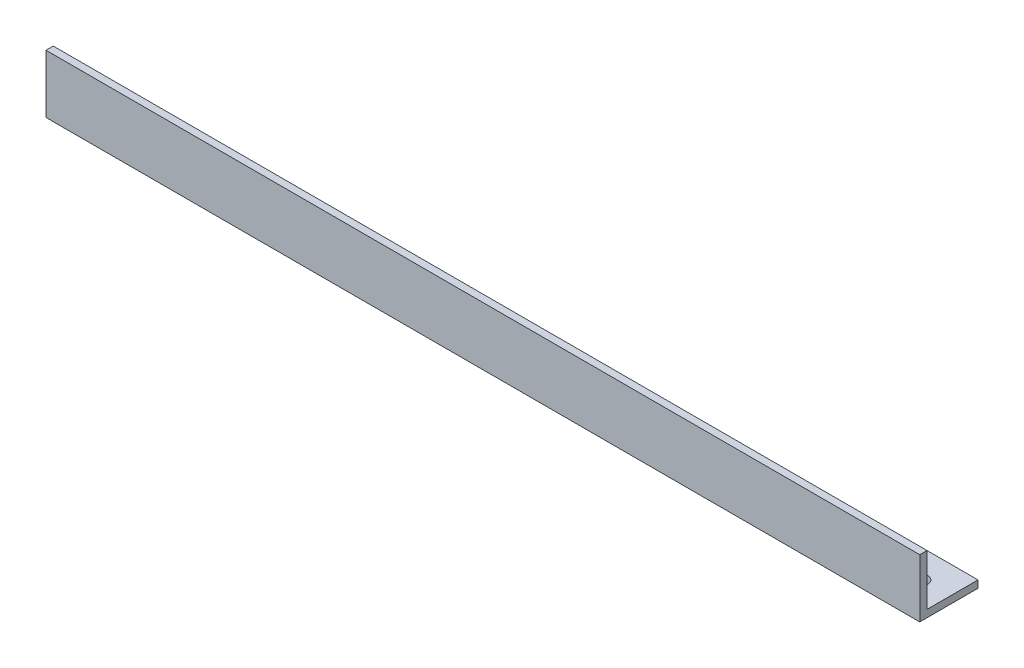
ISO-10303-21;
HEADER;
FILE_DESCRIPTION(('STEP AP214'),'2;1');
FILE_NAME('part.step','',(''),(''),'','','');
FILE_SCHEMA(('AUTOMOTIVE_DESIGN { 1 0 10303 214 1 1 1 1 }'));
ENDSEC;
DATA;
#1=APPLICATION_CONTEXT('core data for automotive mechanical design processes');
#2=APPLICATION_PROTOCOL_DEFINITION('international standard','automotive_design',2000,#1);
#3=PRODUCT_CONTEXT('',#1,'mechanical');
#4=PRODUCT('Part','Part','',(#3));
#5=PRODUCT_RELATED_PRODUCT_CATEGORY('part','',(#4));
#6=PRODUCT_DEFINITION_FORMATION('','',#4);
#7=PRODUCT_DEFINITION_CONTEXT('part definition',#1,'design');
#8=PRODUCT_DEFINITION('design','',#6,#7);
#9=PRODUCT_DEFINITION_SHAPE('','',#8);
#10=(LENGTH_UNIT() NAMED_UNIT(*) SI_UNIT(.MILLI.,.METRE.));
#11=(NAMED_UNIT(*) PLANE_ANGLE_UNIT() SI_UNIT($,.RADIAN.));
#12=(NAMED_UNIT(*) SI_UNIT($,.STERADIAN.) SOLID_ANGLE_UNIT());
#13=UNCERTAINTY_MEASURE_WITH_UNIT(LENGTH_MEASURE(1.E-05),#10,'distance_accuracy_value','');
#14=(GEOMETRIC_REPRESENTATION_CONTEXT(3) GLOBAL_UNCERTAINTY_ASSIGNED_CONTEXT((#13)) GLOBAL_UNIT_ASSIGNED_CONTEXT((#10,
#11,#12)) REPRESENTATION_CONTEXT('',''));
#15=CARTESIAN_POINT('',(0.,0.,0.));
#16=DIRECTION('',(0.,0.,1.));
#17=DIRECTION('',(1.,0.,0.));
#18=AXIS2_PLACEMENT_3D('',#15,#16,#17);
#19=CARTESIAN_POINT('',(381.,0.,0.));
#20=DIRECTION('',(0.,0.,-1.));
#21=DIRECTION('',(-1.,0.,0.));
#22=AXIS2_PLACEMENT_3D('',#19,#20,#21);
#23=PLANE('',#22);
#24=DIRECTION('',(0.,-1.,0.));
#25=VECTOR('',#24,1.);
#26=CARTESIAN_POINT('',(0.,0.,0.));
#27=LINE('',#26,#25);
#28=CARTESIAN_POINT('',(0.,25.4,0.));
#29=VERTEX_POINT('',#28);
#30=CARTESIAN_POINT('',(0.,0.,0.));
#31=VERTEX_POINT('',#30);
#32=EDGE_CURVE('E117',#29,#31,#27,.T.);
#33=ORIENTED_EDGE('',*,*,#32,.T.);
#34=DIRECTION('',(-1.,0.,0.));
#35=VECTOR('',#34,1.);
#36=CARTESIAN_POINT('',(381.,0.,0.));
#37=LINE('',#36,#35);
#38=CARTESIAN_POINT('',(381.,0.,0.));
#39=VERTEX_POINT('',#38);
#40=EDGE_CURVE('E11',#39,#31,#37,.T.);
#41=ORIENTED_EDGE('',*,*,#40,.F.);
#42=DIRECTION('',(0.,-1.,0.));
#43=VECTOR('',#42,1.);
#44=CARTESIAN_POINT('',(381.,0.,0.));
#45=LINE('',#44,#43);
#46=CARTESIAN_POINT('',(381.,25.4,0.));
#47=VERTEX_POINT('',#46);
#48=EDGE_CURVE('E128',#47,#39,#45,.T.);
#49=ORIENTED_EDGE('',*,*,#48,.F.);
#50=DIRECTION('',(-1.,0.,0.));
#51=VECTOR('',#50,1.);
#52=CARTESIAN_POINT('',(381.,25.4,0.));
#53=LINE('',#52,#51);
#54=EDGE_CURVE('E113',#47,#29,#53,.T.);
#55=ORIENTED_EDGE('',*,*,#54,.T.);
#56=EDGE_LOOP('',(#33,#41,#49,#55));
#57=FACE_BOUND('',#56,.T.);
#58=ADVANCED_FACE('F33',(#57),#23,.F.);
#59=CARTESIAN_POINT('',(381.,0.,0.));
#60=DIRECTION('',(0.,1.,0.));
#61=DIRECTION('',(0.,0.,1.));
#62=AXIS2_PLACEMENT_3D('',#59,#60,#61);
#63=PLANE('',#62);
#64=CARTESIAN_POINT('',(19.05,0.,-12.7));
#65=DIRECTION('',(0.,-1.,0.));
#66=DIRECTION('',(0.,0.,-1.));
#67=AXIS2_PLACEMENT_3D('',#64,#65,#66);
#68=CIRCLE('',#67,3.429);
#69=CARTESIAN_POINT('',(19.05,0.,-16.129));
#70=VERTEX_POINT('',#69);
#71=EDGE_CURVE('E188',#70,#70,#68,.T.);
#72=ORIENTED_EDGE('',*,*,#71,.F.);
#73=EDGE_LOOP('',(#72));
#74=FACE_BOUND('',#73,.T.);
#75=CARTESIAN_POINT('',(368.3,0.,-12.7));
#76=DIRECTION('',(0.,-1.,0.));
#77=DIRECTION('',(0.,0.,-1.));
#78=AXIS2_PLACEMENT_3D('',#75,#76,#77);
#79=CIRCLE('',#78,3.429);
#80=CARTESIAN_POINT('',(368.3,0.,-16.129));
#81=VERTEX_POINT('',#80);
#82=EDGE_CURVE('E187',#81,#81,#79,.T.);
#83=ORIENTED_EDGE('',*,*,#82,.F.);
#84=EDGE_LOOP('',(#83));
#85=FACE_BOUND('',#84,.T.);
#86=CARTESIAN_POINT('',(73.66,0.,-12.7));
#87=DIRECTION('',(0.,-1.,0.));
#88=DIRECTION('',(0.,0.,-1.));
#89=AXIS2_PLACEMENT_3D('',#86,#87,#88);
#90=CIRCLE('',#89,3.429);
#91=CARTESIAN_POINT('',(73.66,0.,-16.129));
#92=VERTEX_POINT('',#91);
#93=EDGE_CURVE('E179',#92,#92,#90,.T.);
#94=ORIENTED_EDGE('',*,*,#93,.F.);
#95=EDGE_LOOP('',(#94));
#96=FACE_BOUND('',#95,.T.);
#97=DIRECTION('',(0.,0.,-1.));
#98=VECTOR('',#97,1.);
#99=CARTESIAN_POINT('',(0.,0.,0.));
#100=LINE('',#99,#98);
#101=CARTESIAN_POINT('',(0.,0.,-25.4));
#102=VERTEX_POINT('',#101);
#103=EDGE_CURVE('E120',#31,#102,#100,.T.);
#104=ORIENTED_EDGE('',*,*,#103,.T.);
#105=DIRECTION('',(-1.,0.,0.));
#106=VECTOR('',#105,1.);
#107=CARTESIAN_POINT('',(381.,0.,-25.4));
#108=LINE('',#107,#106);
#109=CARTESIAN_POINT('',(381.,0.,-25.4));
#110=VERTEX_POINT('',#109);
#111=EDGE_CURVE('E41',#110,#102,#108,.T.);
#112=ORIENTED_EDGE('',*,*,#111,.F.);
#113=DIRECTION('',(0.,0.,-1.));
#114=VECTOR('',#113,1.);
#115=CARTESIAN_POINT('',(381.,0.,0.));
#116=LINE('',#115,#114);
#117=EDGE_CURVE('E86',#39,#110,#116,.T.);
#118=ORIENTED_EDGE('',*,*,#117,.F.);
#119=ORIENTED_EDGE('',*,*,#40,.T.);
#120=EDGE_LOOP('',(#104,#112,#118,#119));
#121=FACE_BOUND('',#120,.T.);
#122=ADVANCED_FACE('F152',(#74,#85,#96,#121),#63,.F.);
#123=CARTESIAN_POINT('',(381.,3.175,-25.4));
#124=DIRECTION('',(0.,0.,1.));
#125=DIRECTION('',(1.,0.,0.));
#126=AXIS2_PLACEMENT_3D('',#123,#124,#125);
#127=PLANE('',#126);
#128=DIRECTION('',(0.,1.,0.));
#129=VECTOR('',#128,1.);
#130=CARTESIAN_POINT('',(0.,3.175,-25.4));
#131=LINE('',#130,#129);
#132=CARTESIAN_POINT('',(0.,3.175,-25.4));
#133=VERTEX_POINT('',#132);
#134=EDGE_CURVE('E123',#102,#133,#131,.T.);
#135=ORIENTED_EDGE('',*,*,#134,.T.);
#136=DIRECTION('',(-1.,0.,0.));
#137=VECTOR('',#136,1.);
#138=CARTESIAN_POINT('',(381.,3.175,-25.4));
#139=LINE('',#138,#137);
#140=CARTESIAN_POINT('',(381.,3.175,-25.4));
#141=VERTEX_POINT('',#140);
#142=EDGE_CURVE('E108',#141,#133,#139,.T.);
#143=ORIENTED_EDGE('',*,*,#142,.F.);
#144=DIRECTION('',(0.,1.,0.));
#145=VECTOR('',#144,1.);
#146=CARTESIAN_POINT('',(381.,3.175,-25.4));
#147=LINE('',#146,#145);
#148=EDGE_CURVE('E99',#110,#141,#147,.T.);
#149=ORIENTED_EDGE('',*,*,#148,.F.);
#150=ORIENTED_EDGE('',*,*,#111,.T.);
#151=EDGE_LOOP('',(#135,#143,#149,#150));
#152=FACE_BOUND('',#151,.T.);
#153=ADVANCED_FACE('F134',(#152),#127,.F.);
#154=CARTESIAN_POINT('',(381.,3.175,-3.175));
#155=DIRECTION('',(0.,-1.,0.));
#156=DIRECTION('',(0.,0.,-1.));
#157=AXIS2_PLACEMENT_3D('',#154,#155,#156);
#158=PLANE('',#157);
#159=CARTESIAN_POINT('',(19.05,3.175,-12.7));
#160=DIRECTION('',(0.,-1.,0.));
#161=DIRECTION('',(0.,0.,-1.));
#162=AXIS2_PLACEMENT_3D('',#159,#160,#161);
#163=CIRCLE('',#162,3.429);
#164=CARTESIAN_POINT('',(19.05,3.175,-16.129));
#165=VERTEX_POINT('',#164);
#166=EDGE_CURVE('E171',#165,#165,#163,.F.);
#167=ORIENTED_EDGE('',*,*,#166,.F.);
#168=EDGE_LOOP('',(#167));
#169=FACE_BOUND('',#168,.T.);
#170=CARTESIAN_POINT('',(368.3,3.175,-12.7));
#171=DIRECTION('',(0.,-1.,0.));
#172=DIRECTION('',(0.,0.,-1.));
#173=AXIS2_PLACEMENT_3D('',#170,#171,#172);
#174=CIRCLE('',#173,3.429);
#175=CARTESIAN_POINT('',(368.3,3.175,-16.129));
#176=VERTEX_POINT('',#175);
#177=EDGE_CURVE('E175',#176,#176,#174,.F.);
#178=ORIENTED_EDGE('',*,*,#177,.F.);
#179=EDGE_LOOP('',(#178));
#180=FACE_BOUND('',#179,.T.);
#181=CARTESIAN_POINT('',(73.66,3.175,-12.7));
#182=DIRECTION('',(0.,-1.,0.));
#183=DIRECTION('',(0.,0.,-1.));
#184=AXIS2_PLACEMENT_3D('',#181,#182,#183);
#185=CIRCLE('',#184,3.429);
#186=CARTESIAN_POINT('',(73.66,3.175,-16.129));
#187=VERTEX_POINT('',#186);
#188=EDGE_CURVE('E121',#187,#187,#185,.F.);
#189=ORIENTED_EDGE('',*,*,#188,.F.);
#190=EDGE_LOOP('',(#189));
#191=FACE_BOUND('',#190,.T.);
#192=DIRECTION('',(0.,0.,1.));
#193=VECTOR('',#192,1.);
#194=CARTESIAN_POINT('',(0.,3.175,-3.175));
#195=LINE('',#194,#193);
#196=CARTESIAN_POINT('',(0.,3.175,-3.175));
#197=VERTEX_POINT('',#196);
#198=EDGE_CURVE('E107',#133,#197,#195,.T.);
#199=ORIENTED_EDGE('',*,*,#198,.T.);
#200=DIRECTION('',(-1.,0.,0.));
#201=VECTOR('',#200,1.);
#202=CARTESIAN_POINT('',(381.,3.175,-3.175));
#203=LINE('',#202,#201);
#204=CARTESIAN_POINT('',(381.,3.175,-3.175));
#205=VERTEX_POINT('',#204);
#206=EDGE_CURVE('E104',#205,#197,#203,.T.);
#207=ORIENTED_EDGE('',*,*,#206,.F.);
#208=DIRECTION('',(0.,0.,1.));
#209=VECTOR('',#208,1.);
#210=CARTESIAN_POINT('',(381.,3.175,-3.175));
#211=LINE('',#210,#209);
#212=EDGE_CURVE('E93',#141,#205,#211,.T.);
#213=ORIENTED_EDGE('',*,*,#212,.F.);
#214=ORIENTED_EDGE('',*,*,#142,.T.);
#215=EDGE_LOOP('',(#199,#207,#213,#214));
#216=FACE_BOUND('',#215,.T.);
#217=ADVANCED_FACE('F105',(#169,#180,#191,#216),#158,.F.);
#218=CARTESIAN_POINT('',(381.,25.4,-3.175));
#219=DIRECTION('',(0.,0.,1.));
#220=DIRECTION('',(0.,-1.,0.));
#221=AXIS2_PLACEMENT_3D('',#218,#219,#220);
#222=PLANE('',#221);
#223=DIRECTION('',(0.,1.,0.));
#224=VECTOR('',#223,1.);
#225=CARTESIAN_POINT('',(0.,25.4,-3.175));
#226=LINE('',#225,#224);
#227=CARTESIAN_POINT('',(0.,25.4,-3.175));
#228=VERTEX_POINT('',#227);
#229=EDGE_CURVE('E72',#197,#228,#226,.T.);
#230=ORIENTED_EDGE('',*,*,#229,.T.);
#231=DIRECTION('',(-1.,0.,0.));
#232=VECTOR('',#231,1.);
#233=CARTESIAN_POINT('',(381.,25.4,-3.175));
#234=LINE('',#233,#232);
#235=CARTESIAN_POINT('',(381.,25.4,-3.175));
#236=VERTEX_POINT('',#235);
#237=EDGE_CURVE('E109',#236,#228,#234,.T.);
#238=ORIENTED_EDGE('',*,*,#237,.F.);
#239=DIRECTION('',(0.,1.,0.));
#240=VECTOR('',#239,1.);
#241=CARTESIAN_POINT('',(381.,25.4,-3.175));
#242=LINE('',#241,#240);
#243=EDGE_CURVE('E97',#205,#236,#242,.T.);
#244=ORIENTED_EDGE('',*,*,#243,.F.);
#245=ORIENTED_EDGE('',*,*,#206,.T.);
#246=EDGE_LOOP('',(#230,#238,#244,#245));
#247=FACE_BOUND('',#246,.T.);
#248=ADVANCED_FACE('F111',(#247),#222,.F.);
#249=CARTESIAN_POINT('',(381.,25.4,0.));
#250=DIRECTION('',(0.,-1.,0.));
#251=DIRECTION('',(0.,0.,-1.));
#252=AXIS2_PLACEMENT_3D('',#249,#250,#251);
#253=PLANE('',#252);
#254=DIRECTION('',(0.,0.,1.));
#255=VECTOR('',#254,1.);
#256=CARTESIAN_POINT('',(0.,25.4,0.));
#257=LINE('',#256,#255);
#258=EDGE_CURVE('E78',#228,#29,#257,.T.);
#259=ORIENTED_EDGE('',*,*,#258,.T.);
#260=ORIENTED_EDGE('',*,*,#54,.F.);
#261=DIRECTION('',(0.,0.,1.));
#262=VECTOR('',#261,1.);
#263=CARTESIAN_POINT('',(381.,25.4,0.));
#264=LINE('',#263,#262);
#265=EDGE_CURVE('E49',#236,#47,#264,.T.);
#266=ORIENTED_EDGE('',*,*,#265,.F.);
#267=ORIENTED_EDGE('',*,*,#237,.T.);
#268=EDGE_LOOP('',(#259,#260,#266,#267));
#269=FACE_BOUND('',#268,.T.);
#270=ADVANCED_FACE('F141',(#269),#253,.F.);
#271=CARTESIAN_POINT('',(381.,0.,0.));
#272=DIRECTION('',(-1.,0.,0.));
#273=DIRECTION('',(0.,0.,1.));
#274=AXIS2_PLACEMENT_3D('',#271,#272,#273);
#275=PLANE('',#274);
#276=ORIENTED_EDGE('',*,*,#48,.T.);
#277=ORIENTED_EDGE('',*,*,#117,.T.);
#278=ORIENTED_EDGE('',*,*,#148,.T.);
#279=ORIENTED_EDGE('',*,*,#212,.T.);
#280=ORIENTED_EDGE('',*,*,#243,.T.);
#281=ORIENTED_EDGE('',*,*,#265,.T.);
#282=EDGE_LOOP('',(#276,#277,#278,#279,#280,#281));
#283=FACE_BOUND('',#282,.T.);
#284=ADVANCED_FACE('F95',(#283),#275,.F.);
#285=CARTESIAN_POINT('',(0.,0.,0.));
#286=DIRECTION('',(-1.,0.,0.));
#287=DIRECTION('',(0.,0.,1.));
#288=AXIS2_PLACEMENT_3D('',#285,#286,#287);
#289=PLANE('',#288);
#290=ORIENTED_EDGE('',*,*,#32,.F.);
#291=ORIENTED_EDGE('',*,*,#258,.F.);
#292=ORIENTED_EDGE('',*,*,#229,.F.);
#293=ORIENTED_EDGE('',*,*,#198,.F.);
#294=ORIENTED_EDGE('',*,*,#134,.F.);
#295=ORIENTED_EDGE('',*,*,#103,.F.);
#296=EDGE_LOOP('',(#290,#291,#292,#293,#294,#295));
#297=FACE_BOUND('',#296,.T.);
#298=ADVANCED_FACE('F137',(#297),#289,.T.);
#299=CARTESIAN_POINT('',(73.66,25.401,-12.7));
#300=DIRECTION('',(0.,-1.,0.));
#301=DIRECTION('',(0.,0.,-1.));
#302=AXIS2_PLACEMENT_3D('',#299,#300,#301);
#303=CYLINDRICAL_SURFACE('',#302,3.429);
#304=ORIENTED_EDGE('',*,*,#93,.T.);
#305=EDGE_LOOP('',(#304));
#306=FACE_BOUND('',#305,.T.);
#307=ORIENTED_EDGE('',*,*,#188,.T.);
#308=EDGE_LOOP('',(#307));
#309=FACE_BOUND('',#308,.T.);
#310=ADVANCED_FACE('F200',(#306,#309),#303,.F.);
#311=CARTESIAN_POINT('',(368.3,25.401,-12.7));
#312=DIRECTION('',(0.,-1.,0.));
#313=DIRECTION('',(0.,0.,-1.));
#314=AXIS2_PLACEMENT_3D('',#311,#312,#313);
#315=CYLINDRICAL_SURFACE('',#314,3.429);
#316=ORIENTED_EDGE('',*,*,#82,.T.);
#317=EDGE_LOOP('',(#316));
#318=FACE_BOUND('',#317,.T.);
#319=ORIENTED_EDGE('',*,*,#177,.T.);
#320=EDGE_LOOP('',(#319));
#321=FACE_BOUND('',#320,.T.);
#322=ADVANCED_FACE('F195',(#318,#321),#315,.F.);
#323=CARTESIAN_POINT('',(19.05,25.401,-12.7));
#324=DIRECTION('',(0.,-1.,0.));
#325=DIRECTION('',(0.,0.,-1.));
#326=AXIS2_PLACEMENT_3D('',#323,#324,#325);
#327=CYLINDRICAL_SURFACE('',#326,3.429);
#328=ORIENTED_EDGE('',*,*,#71,.T.);
#329=EDGE_LOOP('',(#328));
#330=FACE_BOUND('',#329,.T.);
#331=ORIENTED_EDGE('',*,*,#166,.T.);
#332=EDGE_LOOP('',(#331));
#333=FACE_BOUND('',#332,.T.);
#334=ADVANCED_FACE('F207',(#330,#333),#327,.F.);
#335=CLOSED_SHELL('',(#58,#122,#153,#217,#248,#270,#284,#298,#310,#322,#334));
#336=MANIFOLD_SOLID_BREP('B2',#335);
#337=ADVANCED_BREP_SHAPE_REPRESENTATION('',(#18,#336),#14);
#338=SHAPE_DEFINITION_REPRESENTATION(#9,#337);
ENDSEC;
END-ISO-10303-21;
